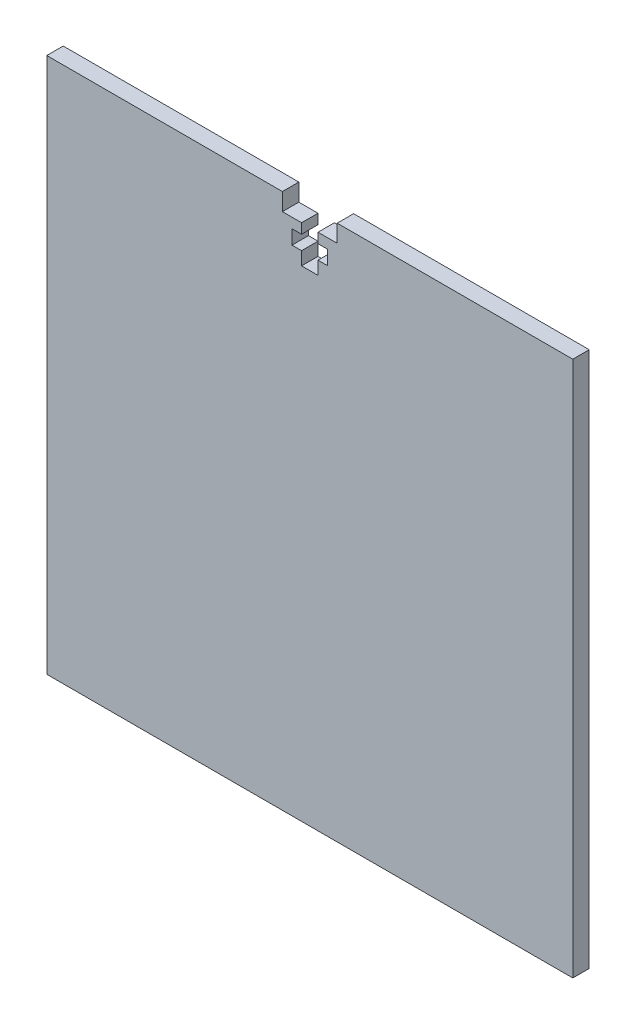
ISO-10303-21;
HEADER;
FILE_DESCRIPTION(('STEP AP214'),'2;1');
FILE_NAME('part.step','',(''),(''),'','','');
FILE_SCHEMA(('AUTOMOTIVE_DESIGN { 1 0 10303 214 1 1 1 1 }'));
ENDSEC;
DATA;
#1=APPLICATION_CONTEXT('core data for automotive mechanical design processes');
#2=APPLICATION_PROTOCOL_DEFINITION('international standard','automotive_design',2000,#1);
#3=PRODUCT_CONTEXT('',#1,'mechanical');
#4=PRODUCT('Part','Part','',(#3));
#5=PRODUCT_RELATED_PRODUCT_CATEGORY('part','',(#4));
#6=PRODUCT_DEFINITION_FORMATION('','',#4);
#7=PRODUCT_DEFINITION_CONTEXT('part definition',#1,'design');
#8=PRODUCT_DEFINITION('design','',#6,#7);
#9=PRODUCT_DEFINITION_SHAPE('','',#8);
#10=(LENGTH_UNIT() NAMED_UNIT(*) SI_UNIT(.MILLI.,.METRE.));
#11=(NAMED_UNIT(*) PLANE_ANGLE_UNIT() SI_UNIT($,.RADIAN.));
#12=(NAMED_UNIT(*) SI_UNIT($,.STERADIAN.) SOLID_ANGLE_UNIT());
#13=UNCERTAINTY_MEASURE_WITH_UNIT(LENGTH_MEASURE(1.E-05),#10,'distance_accuracy_value','');
#14=(GEOMETRIC_REPRESENTATION_CONTEXT(3) GLOBAL_UNCERTAINTY_ASSIGNED_CONTEXT((#13)) GLOBAL_UNIT_ASSIGNED_CONTEXT((#10,
#11,#12)) REPRESENTATION_CONTEXT('',''));
#15=CARTESIAN_POINT('',(0.,0.,0.));
#16=DIRECTION('',(0.,0.,1.));
#17=DIRECTION('',(1.,0.,0.));
#18=AXIS2_PLACEMENT_3D('',#15,#16,#17);
#19=CARTESIAN_POINT('',(-47.9962052336153,48.8993596331726,3.));
#20=DIRECTION('',(0.,-1.,0.));
#21=DIRECTION('',(0.,0.,-1.));
#22=AXIS2_PLACEMENT_3D('',#19,#20,#21);
#23=PLANE('',#22);
#24=DIRECTION('',(-1.,0.,0.));
#25=VECTOR('',#24,1.);
#26=CARTESIAN_POINT('',(-47.9962052336153,48.8993596331726,3.));
#27=LINE('',#26,#25);
#28=CARTESIAN_POINT('',(-5.,48.8993596331726,3.));
#29=VERTEX_POINT('',#28);
#30=CARTESIAN_POINT('',(-47.9962052336153,48.8993596331726,3.));
#31=VERTEX_POINT('',#30);
#32=EDGE_CURVE('E319',#29,#31,#27,.T.);
#33=ORIENTED_EDGE('',*,*,#32,.F.);
#34=DIRECTION('',(0.,0.,1.));
#35=VECTOR('',#34,1.);
#36=CARTESIAN_POINT('',(-5.,48.8993596331726,0.));
#37=LINE('',#36,#35);
#38=CARTESIAN_POINT('',(-5.,48.8993596331726,0.));
#39=VERTEX_POINT('',#38);
#40=EDGE_CURVE('E287',#39,#29,#37,.T.);
#41=ORIENTED_EDGE('',*,*,#40,.F.);
#42=DIRECTION('',(-1.,0.,0.));
#43=VECTOR('',#42,1.);
#44=CARTESIAN_POINT('',(-47.9962052336153,48.8993596331726,0.));
#45=LINE('',#44,#43);
#46=CARTESIAN_POINT('',(-47.9962052336153,48.8993596331726,0.));
#47=VERTEX_POINT('',#46);
#48=EDGE_CURVE('E207',#39,#47,#45,.T.);
#49=ORIENTED_EDGE('',*,*,#48,.T.);
#50=DIRECTION('',(0.,0.,-1.));
#51=VECTOR('',#50,1.);
#52=CARTESIAN_POINT('',(-47.9962052336153,48.8993596331726,3.));
#53=LINE('',#52,#51);
#54=EDGE_CURVE('E47',#31,#47,#53,.T.);
#55=ORIENTED_EDGE('',*,*,#54,.F.);
#56=EDGE_LOOP('',(#33,#41,#49,#55));
#57=FACE_BOUND('',#56,.T.);
#58=ADVANCED_FACE('F39',(#57),#23,.F.);
#59=CARTESIAN_POINT('',(47.9962052336153,48.8993596331726,3.));
#60=DIRECTION('',(-1.,0.,0.));
#61=DIRECTION('',(0.,0.,1.));
#62=AXIS2_PLACEMENT_3D('',#59,#60,#61);
#63=PLANE('',#62);
#64=DIRECTION('',(0.,1.,0.));
#65=VECTOR('',#64,1.);
#66=CARTESIAN_POINT('',(47.9962052336153,48.8993596331726,0.));
#67=LINE('',#66,#65);
#68=CARTESIAN_POINT('',(47.9962052336153,-48.8993596331726,0.));
#69=VERTEX_POINT('',#68);
#70=CARTESIAN_POINT('',(47.9962052336153,48.8993596331726,0.));
#71=VERTEX_POINT('',#70);
#72=EDGE_CURVE('E289',#69,#71,#67,.T.);
#73=ORIENTED_EDGE('',*,*,#72,.T.);
#74=DIRECTION('',(0.,0.,-1.));
#75=VECTOR('',#74,1.);
#76=CARTESIAN_POINT('',(47.9962052336153,48.8993596331726,3.));
#77=LINE('',#76,#75);
#78=CARTESIAN_POINT('',(47.9962052336153,48.8993596331726,3.));
#79=VERTEX_POINT('',#78);
#80=EDGE_CURVE('E11',#79,#71,#77,.T.);
#81=ORIENTED_EDGE('',*,*,#80,.F.);
#82=DIRECTION('',(0.,1.,0.));
#83=VECTOR('',#82,1.);
#84=CARTESIAN_POINT('',(47.9962052336153,48.8993596331726,3.));
#85=LINE('',#84,#83);
#86=CARTESIAN_POINT('',(47.9962052336153,-48.8993596331726,3.));
#87=VERTEX_POINT('',#86);
#88=EDGE_CURVE('E317',#87,#79,#85,.T.);
#89=ORIENTED_EDGE('',*,*,#88,.F.);
#90=DIRECTION('',(0.,0.,-1.));
#91=VECTOR('',#90,1.);
#92=CARTESIAN_POINT('',(47.9962052336153,-48.8993596331726,3.));
#93=LINE('',#92,#91);
#94=EDGE_CURVE('E325',#87,#69,#93,.T.);
#95=ORIENTED_EDGE('',*,*,#94,.T.);
#96=EDGE_LOOP('',(#73,#81,#89,#95));
#97=FACE_BOUND('',#96,.T.);
#98=ADVANCED_FACE('F41',(#97),#63,.F.);
#99=CARTESIAN_POINT('',(5.,48.8993596331726,0.));
#100=VERTEX_POINT('',#99);
#101=EDGE_CURVE('E328',#71,#100,#45,.T.);
#102=ORIENTED_EDGE('',*,*,#101,.T.);
#103=DIRECTION('',(0.,0.,1.));
#104=VECTOR('',#103,1.);
#105=CARTESIAN_POINT('',(5.,48.8993596331726,0.));
#106=LINE('',#105,#104);
#107=CARTESIAN_POINT('',(5.,48.8993596331726,3.));
#108=VERTEX_POINT('',#107);
#109=EDGE_CURVE('E290',#100,#108,#106,.T.);
#110=ORIENTED_EDGE('',*,*,#109,.T.);
#111=EDGE_CURVE('E91',#79,#108,#27,.T.);
#112=ORIENTED_EDGE('',*,*,#111,.F.);
#113=ORIENTED_EDGE('',*,*,#80,.T.);
#114=EDGE_LOOP('',(#102,#110,#112,#113));
#115=FACE_BOUND('',#114,.T.);
#116=ADVANCED_FACE('F357',(#115),#23,.F.);
#117=CARTESIAN_POINT('',(-47.9962052336153,48.8993596331726,3.));
#118=DIRECTION('',(1.,0.,0.));
#119=DIRECTION('',(0.,0.,-1.));
#120=AXIS2_PLACEMENT_3D('',#117,#118,#119);
#121=PLANE('',#120);
#122=DIRECTION('',(0.,-1.,0.));
#123=VECTOR('',#122,1.);
#124=CARTESIAN_POINT('',(-47.9962052336153,48.8993596331726,0.));
#125=LINE('',#124,#123);
#126=CARTESIAN_POINT('',(-47.9962052336153,-48.8993596331726,0.));
#127=VERTEX_POINT('',#126);
#128=EDGE_CURVE('E331',#47,#127,#125,.T.);
#129=ORIENTED_EDGE('',*,*,#128,.T.);
#130=DIRECTION('',(0.,0.,-1.));
#131=VECTOR('',#130,1.);
#132=CARTESIAN_POINT('',(-47.9962052336153,-48.8993596331726,3.));
#133=LINE('',#132,#131);
#134=CARTESIAN_POINT('',(-47.9962052336153,-48.8993596331726,3.));
#135=VERTEX_POINT('',#134);
#136=EDGE_CURVE('E335',#135,#127,#133,.T.);
#137=ORIENTED_EDGE('',*,*,#136,.F.);
#138=DIRECTION('',(0.,-1.,0.));
#139=VECTOR('',#138,1.);
#140=CARTESIAN_POINT('',(-47.9962052336153,48.8993596331726,3.));
#141=LINE('',#140,#139);
#142=EDGE_CURVE('E322',#31,#135,#141,.T.);
#143=ORIENTED_EDGE('',*,*,#142,.F.);
#144=ORIENTED_EDGE('',*,*,#54,.T.);
#145=EDGE_LOOP('',(#129,#137,#143,#144));
#146=FACE_BOUND('',#145,.T.);
#147=ADVANCED_FACE('F340',(#146),#121,.F.);
#148=CARTESIAN_POINT('',(-47.9962052336153,-48.8993596331726,3.));
#149=DIRECTION('',(0.,1.,0.));
#150=DIRECTION('',(0.,0.,1.));
#151=AXIS2_PLACEMENT_3D('',#148,#149,#150);
#152=PLANE('',#151);
#153=DIRECTION('',(1.,0.,0.));
#154=VECTOR('',#153,1.);
#155=CARTESIAN_POINT('',(-47.9962052336153,-48.8993596331726,0.));
#156=LINE('',#155,#154);
#157=EDGE_CURVE('E84',#127,#69,#156,.T.);
#158=ORIENTED_EDGE('',*,*,#157,.T.);
#159=ORIENTED_EDGE('',*,*,#94,.F.);
#160=DIRECTION('',(1.,0.,0.));
#161=VECTOR('',#160,1.);
#162=CARTESIAN_POINT('',(-47.9962052336153,-48.8993596331726,3.));
#163=LINE('',#162,#161);
#164=EDGE_CURVE('E63',#135,#87,#163,.T.);
#165=ORIENTED_EDGE('',*,*,#164,.F.);
#166=ORIENTED_EDGE('',*,*,#136,.T.);
#167=EDGE_LOOP('',(#158,#159,#165,#166));
#168=FACE_BOUND('',#167,.T.);
#169=ADVANCED_FACE('F348',(#168),#152,.F.);
#170=CARTESIAN_POINT('',(0.,0.,3.));
#171=DIRECTION('',(0.,0.,1.));
#172=DIRECTION('',(1.,0.,0.));
#173=AXIS2_PLACEMENT_3D('',#170,#171,#172);
#174=PLANE('',#173);
#175=DIRECTION('',(0.,-1.,0.));
#176=VECTOR('',#175,1.);
#177=CARTESIAN_POINT('',(-5.,48.8993596331726,3.));
#178=LINE('',#177,#176);
#179=CARTESIAN_POINT('',(-5.00000000000001,45.7193596331726,3.));
#180=VERTEX_POINT('',#179);
#181=EDGE_CURVE('E192',#29,#180,#178,.T.);
#182=ORIENTED_EDGE('',*,*,#181,.F.);
#183=ORIENTED_EDGE('',*,*,#32,.T.);
#184=ORIENTED_EDGE('',*,*,#142,.T.);
#185=ORIENTED_EDGE('',*,*,#164,.T.);
#186=ORIENTED_EDGE('',*,*,#88,.T.);
#187=ORIENTED_EDGE('',*,*,#111,.T.);
#188=DIRECTION('',(0.,1.,0.));
#189=VECTOR('',#188,1.);
#190=CARTESIAN_POINT('',(5.,48.8993596331726,3.));
#191=LINE('',#190,#189);
#192=CARTESIAN_POINT('',(4.99999999999999,45.7193596331726,3.));
#193=VERTEX_POINT('',#192);
#194=EDGE_CURVE('E208',#193,#108,#191,.T.);
#195=ORIENTED_EDGE('',*,*,#194,.F.);
#196=DIRECTION('',(1.,0.,0.));
#197=VECTOR('',#196,1.);
#198=CARTESIAN_POINT('',(1.5,45.7193596331726,3.));
#199=LINE('',#198,#197);
#200=CARTESIAN_POINT('',(1.5,45.7193596331726,3.));
#201=VERTEX_POINT('',#200);
#202=EDGE_CURVE('E210',#201,#193,#199,.T.);
#203=ORIENTED_EDGE('',*,*,#202,.F.);
#204=DIRECTION('',(0.,1.,0.));
#205=VECTOR('',#204,1.);
#206=CARTESIAN_POINT('',(1.5,45.7193596331726,3.));
#207=LINE('',#206,#205);
#208=CARTESIAN_POINT('',(1.5,43.8993596331726,3.));
#209=VERTEX_POINT('',#208);
#210=EDGE_CURVE('E282',#209,#201,#207,.T.);
#211=ORIENTED_EDGE('',*,*,#210,.F.);
#212=DIRECTION('',(-1.,0.,0.));
#213=VECTOR('',#212,1.);
#214=CARTESIAN_POINT('',(3.25000000000001,43.8993596331726,3.));
#215=LINE('',#214,#213);
#216=CARTESIAN_POINT('',(3.25000000000001,43.8993596331726,3.));
#217=VERTEX_POINT('',#216);
#218=EDGE_CURVE('E279',#217,#209,#215,.T.);
#219=ORIENTED_EDGE('',*,*,#218,.F.);
#220=DIRECTION('',(0.,1.,0.));
#221=VECTOR('',#220,1.);
#222=CARTESIAN_POINT('',(3.25000000000001,43.8993596331726,3.));
#223=LINE('',#222,#221);
#224=CARTESIAN_POINT('',(3.24999999999999,41.2993596331726,3.));
#225=VERTEX_POINT('',#224);
#226=EDGE_CURVE('E276',#225,#217,#223,.T.);
#227=ORIENTED_EDGE('',*,*,#226,.F.);
#228=DIRECTION('',(1.,0.,0.));
#229=VECTOR('',#228,1.);
#230=CARTESIAN_POINT('',(1.5,41.2993596331726,3.));
#231=LINE('',#230,#229);
#232=CARTESIAN_POINT('',(1.5,41.2993596331726,3.));
#233=VERTEX_POINT('',#232);
#234=EDGE_CURVE('E273',#233,#225,#231,.T.);
#235=ORIENTED_EDGE('',*,*,#234,.F.);
#236=DIRECTION('',(0.,1.,0.));
#237=VECTOR('',#236,1.);
#238=CARTESIAN_POINT('',(1.5,41.2993596331726,3.));
#239=LINE('',#238,#237);
#240=CARTESIAN_POINT('',(1.5,38.8993596331726,3.));
#241=VERTEX_POINT('',#240);
#242=EDGE_CURVE('E270',#241,#233,#239,.T.);
#243=ORIENTED_EDGE('',*,*,#242,.F.);
#244=DIRECTION('',(1.,0.,0.));
#245=VECTOR('',#244,1.);
#246=CARTESIAN_POINT('',(-1.5,38.8993596331726,3.));
#247=LINE('',#246,#245);
#248=CARTESIAN_POINT('',(-1.5,38.8993596331726,3.));
#249=VERTEX_POINT('',#248);
#250=EDGE_CURVE('E267',#249,#241,#247,.T.);
#251=ORIENTED_EDGE('',*,*,#250,.F.);
#252=DIRECTION('',(0.,-1.,0.));
#253=VECTOR('',#252,1.);
#254=CARTESIAN_POINT('',(-1.5,41.2993596331726,3.));
#255=LINE('',#254,#253);
#256=CARTESIAN_POINT('',(-1.5,41.2993596331726,3.));
#257=VERTEX_POINT('',#256);
#258=EDGE_CURVE('E264',#257,#249,#255,.T.);
#259=ORIENTED_EDGE('',*,*,#258,.F.);
#260=DIRECTION('',(1.,0.,0.));
#261=VECTOR('',#260,1.);
#262=CARTESIAN_POINT('',(-3.25000000000001,41.2993596331726,3.));
#263=LINE('',#262,#261);
#264=CARTESIAN_POINT('',(-3.25000000000001,41.2993596331726,3.));
#265=VERTEX_POINT('',#264);
#266=EDGE_CURVE('E261',#265,#257,#263,.T.);
#267=ORIENTED_EDGE('',*,*,#266,.F.);
#268=DIRECTION('',(0.,-1.,0.));
#269=VECTOR('',#268,1.);
#270=CARTESIAN_POINT('',(-3.25000000000001,43.8993596331726,3.));
#271=LINE('',#270,#269);
#272=CARTESIAN_POINT('',(-3.25000000000001,43.8993596331726,3.));
#273=VERTEX_POINT('',#272);
#274=EDGE_CURVE('E258',#273,#265,#271,.T.);
#275=ORIENTED_EDGE('',*,*,#274,.F.);
#276=DIRECTION('',(-1.,0.,0.));
#277=VECTOR('',#276,1.);
#278=CARTESIAN_POINT('',(-3.25000000000001,43.8993596331726,3.));
#279=LINE('',#278,#277);
#280=CARTESIAN_POINT('',(-1.5,43.8993596331726,3.));
#281=VERTEX_POINT('',#280);
#282=EDGE_CURVE('E255',#281,#273,#279,.T.);
#283=ORIENTED_EDGE('',*,*,#282,.F.);
#284=DIRECTION('',(0.,-1.,0.));
#285=VECTOR('',#284,1.);
#286=CARTESIAN_POINT('',(-1.5,45.7193596331726,3.));
#287=LINE('',#286,#285);
#288=CARTESIAN_POINT('',(-1.5,45.7193596331726,3.));
#289=VERTEX_POINT('',#288);
#290=EDGE_CURVE('E252',#289,#281,#287,.T.);
#291=ORIENTED_EDGE('',*,*,#290,.F.);
#292=DIRECTION('',(1.,0.,0.));
#293=VECTOR('',#292,1.);
#294=CARTESIAN_POINT('',(-5.00000000000001,45.7193596331726,3.));
#295=LINE('',#294,#293);
#296=EDGE_CURVE('E250',#180,#289,#295,.T.);
#297=ORIENTED_EDGE('',*,*,#296,.F.);
#298=EDGE_LOOP('',(#182,#183,#184,#185,#186,#187,#195,#203,#211,#219,#227,#235,#243,#251,#259,
#267,#275,#283,#291,#297));
#299=FACE_BOUND('',#298,.T.);
#300=ADVANCED_FACE('F350',(#299),#174,.T.);
#301=CARTESIAN_POINT('',(0.,0.,0.));
#302=DIRECTION('',(0.,0.,1.));
#303=DIRECTION('',(1.,0.,0.));
#304=AXIS2_PLACEMENT_3D('',#301,#302,#303);
#305=PLANE('',#304);
#306=ORIENTED_EDGE('',*,*,#48,.F.);
#307=DIRECTION('',(0.,-1.,0.));
#308=VECTOR('',#307,1.);
#309=CARTESIAN_POINT('',(-5.,48.8993596331726,0.));
#310=LINE('',#309,#308);
#311=CARTESIAN_POINT('',(-5.00000000000001,45.7193596331726,0.));
#312=VERTEX_POINT('',#311);
#313=EDGE_CURVE('E189',#39,#312,#310,.T.);
#314=ORIENTED_EDGE('',*,*,#313,.T.);
#315=DIRECTION('',(1.,0.,0.));
#316=VECTOR('',#315,1.);
#317=CARTESIAN_POINT('',(-5.00000000000001,45.7193596331726,0.));
#318=LINE('',#317,#316);
#319=CARTESIAN_POINT('',(-1.5,45.7193596331726,0.));
#320=VERTEX_POINT('',#319);
#321=EDGE_CURVE('E200',#312,#320,#318,.T.);
#322=ORIENTED_EDGE('',*,*,#321,.T.);
#323=DIRECTION('',(0.,-1.,0.));
#324=VECTOR('',#323,1.);
#325=CARTESIAN_POINT('',(-1.5,45.7193596331726,0.));
#326=LINE('',#325,#324);
#327=CARTESIAN_POINT('',(-1.5,43.8993596331726,0.));
#328=VERTEX_POINT('',#327);
#329=EDGE_CURVE('E54',#320,#328,#326,.T.);
#330=ORIENTED_EDGE('',*,*,#329,.T.);
#331=DIRECTION('',(-1.,0.,0.));
#332=VECTOR('',#331,1.);
#333=CARTESIAN_POINT('',(-3.25000000000001,43.8993596331726,0.));
#334=LINE('',#333,#332);
#335=CARTESIAN_POINT('',(-3.25000000000001,43.8993596331726,0.));
#336=VERTEX_POINT('',#335);
#337=EDGE_CURVE('E214',#328,#336,#334,.T.);
#338=ORIENTED_EDGE('',*,*,#337,.T.);
#339=DIRECTION('',(0.,-1.,0.));
#340=VECTOR('',#339,1.);
#341=CARTESIAN_POINT('',(-3.25000000000001,43.8993596331726,0.));
#342=LINE('',#341,#340);
#343=CARTESIAN_POINT('',(-3.25000000000001,41.2993596331726,0.));
#344=VERTEX_POINT('',#343);
#345=EDGE_CURVE('E217',#336,#344,#342,.T.);
#346=ORIENTED_EDGE('',*,*,#345,.T.);
#347=DIRECTION('',(1.,0.,0.));
#348=VECTOR('',#347,1.);
#349=CARTESIAN_POINT('',(-3.25000000000001,41.2993596331726,0.));
#350=LINE('',#349,#348);
#351=CARTESIAN_POINT('',(-1.5,41.2993596331726,0.));
#352=VERTEX_POINT('',#351);
#353=EDGE_CURVE('E220',#344,#352,#350,.T.);
#354=ORIENTED_EDGE('',*,*,#353,.T.);
#355=DIRECTION('',(0.,-1.,0.));
#356=VECTOR('',#355,1.);
#357=CARTESIAN_POINT('',(-1.5,41.2993596331726,0.));
#358=LINE('',#357,#356);
#359=CARTESIAN_POINT('',(-1.5,38.8993596331726,0.));
#360=VERTEX_POINT('',#359);
#361=EDGE_CURVE('E223',#352,#360,#358,.T.);
#362=ORIENTED_EDGE('',*,*,#361,.T.);
#363=DIRECTION('',(1.,0.,0.));
#364=VECTOR('',#363,1.);
#365=CARTESIAN_POINT('',(-1.5,38.8993596331726,0.));
#366=LINE('',#365,#364);
#367=CARTESIAN_POINT('',(1.5,38.8993596331726,0.));
#368=VERTEX_POINT('',#367);
#369=EDGE_CURVE('E226',#360,#368,#366,.T.);
#370=ORIENTED_EDGE('',*,*,#369,.T.);
#371=DIRECTION('',(0.,1.,0.));
#372=VECTOR('',#371,1.);
#373=CARTESIAN_POINT('',(1.5,41.2993596331726,0.));
#374=LINE('',#373,#372);
#375=CARTESIAN_POINT('',(1.5,41.2993596331726,0.));
#376=VERTEX_POINT('',#375);
#377=EDGE_CURVE('E229',#368,#376,#374,.T.);
#378=ORIENTED_EDGE('',*,*,#377,.T.);
#379=DIRECTION('',(1.,0.,0.));
#380=VECTOR('',#379,1.);
#381=CARTESIAN_POINT('',(1.5,41.2993596331726,0.));
#382=LINE('',#381,#380);
#383=CARTESIAN_POINT('',(3.24999999999999,41.2993596331726,0.));
#384=VERTEX_POINT('',#383);
#385=EDGE_CURVE('E232',#376,#384,#382,.T.);
#386=ORIENTED_EDGE('',*,*,#385,.T.);
#387=DIRECTION('',(0.,1.,0.));
#388=VECTOR('',#387,1.);
#389=CARTESIAN_POINT('',(3.25000000000001,43.8993596331726,0.));
#390=LINE('',#389,#388);
#391=CARTESIAN_POINT('',(3.25000000000001,43.8993596331726,0.));
#392=VERTEX_POINT('',#391);
#393=EDGE_CURVE('E235',#384,#392,#390,.T.);
#394=ORIENTED_EDGE('',*,*,#393,.T.);
#395=DIRECTION('',(-1.,0.,0.));
#396=VECTOR('',#395,1.);
#397=CARTESIAN_POINT('',(3.25000000000001,43.8993596331726,0.));
#398=LINE('',#397,#396);
#399=CARTESIAN_POINT('',(1.5,43.8993596331726,0.));
#400=VERTEX_POINT('',#399);
#401=EDGE_CURVE('E238',#392,#400,#398,.T.);
#402=ORIENTED_EDGE('',*,*,#401,.T.);
#403=DIRECTION('',(0.,1.,0.));
#404=VECTOR('',#403,1.);
#405=CARTESIAN_POINT('',(1.5,45.7193596331726,0.));
#406=LINE('',#405,#404);
#407=CARTESIAN_POINT('',(1.5,45.7193596331726,0.));
#408=VERTEX_POINT('',#407);
#409=EDGE_CURVE('E241',#400,#408,#406,.T.);
#410=ORIENTED_EDGE('',*,*,#409,.T.);
#411=DIRECTION('',(1.,0.,0.));
#412=VECTOR('',#411,1.);
#413=CARTESIAN_POINT('',(1.5,45.7193596331726,0.));
#414=LINE('',#413,#412);
#415=CARTESIAN_POINT('',(4.99999999999999,45.7193596331726,0.));
#416=VERTEX_POINT('',#415);
#417=EDGE_CURVE('E244',#408,#416,#414,.T.);
#418=ORIENTED_EDGE('',*,*,#417,.T.);
#419=DIRECTION('',(0.,1.,0.));
#420=VECTOR('',#419,1.);
#421=CARTESIAN_POINT('',(5.,48.8993596331726,0.));
#422=LINE('',#421,#420);
#423=EDGE_CURVE('E197',#416,#100,#422,.T.);
#424=ORIENTED_EDGE('',*,*,#423,.T.);
#425=ORIENTED_EDGE('',*,*,#101,.F.);
#426=ORIENTED_EDGE('',*,*,#72,.F.);
#427=ORIENTED_EDGE('',*,*,#157,.F.);
#428=ORIENTED_EDGE('',*,*,#128,.F.);
#429=EDGE_LOOP('',(#306,#314,#322,#330,#338,#346,#354,#362,#370,#378,#386,#394,#402,#410,#418,
#424,#425,#426,#427,#428));
#430=FACE_BOUND('',#429,.T.);
#431=ADVANCED_FACE('F205',(#430),#305,.F.);
#432=CARTESIAN_POINT('',(-5.,48.8993596331726,0.));
#433=DIRECTION('',(-1.,0.,0.));
#434=DIRECTION('',(0.,-1.,0.));
#435=AXIS2_PLACEMENT_3D('',#432,#433,#434);
#436=PLANE('',#435);
#437=ORIENTED_EDGE('',*,*,#181,.T.);
#438=DIRECTION('',(0.,0.,1.));
#439=VECTOR('',#438,1.);
#440=CARTESIAN_POINT('',(-5.00000000000001,45.7193596331726,0.));
#441=LINE('',#440,#439);
#442=EDGE_CURVE('E185',#312,#180,#441,.T.);
#443=ORIENTED_EDGE('',*,*,#442,.F.);
#444=ORIENTED_EDGE('',*,*,#313,.F.);
#445=ORIENTED_EDGE('',*,*,#40,.T.);
#446=EDGE_LOOP('',(#437,#443,#444,#445));
#447=FACE_BOUND('',#446,.T.);
#448=ADVANCED_FACE('F187',(#447),#436,.F.);
#449=CARTESIAN_POINT('',(5.,48.8993596331726,0.));
#450=DIRECTION('',(1.,0.,0.));
#451=DIRECTION('',(0.,1.,0.));
#452=AXIS2_PLACEMENT_3D('',#449,#450,#451);
#453=PLANE('',#452);
#454=ORIENTED_EDGE('',*,*,#194,.T.);
#455=ORIENTED_EDGE('',*,*,#109,.F.);
#456=ORIENTED_EDGE('',*,*,#423,.F.);
#457=DIRECTION('',(0.,0.,1.));
#458=VECTOR('',#457,1.);
#459=CARTESIAN_POINT('',(4.99999999999999,45.7193596331726,0.));
#460=LINE('',#459,#458);
#461=EDGE_CURVE('E292',#416,#193,#460,.T.);
#462=ORIENTED_EDGE('',*,*,#461,.T.);
#463=EDGE_LOOP('',(#454,#455,#456,#462));
#464=FACE_BOUND('',#463,.T.);
#465=ADVANCED_FACE('F372',(#464),#453,.F.);
#466=CARTESIAN_POINT('',(1.5,45.7193596331726,0.));
#467=DIRECTION('',(0.,-1.,0.));
#468=DIRECTION('',(1.,0.,0.));
#469=AXIS2_PLACEMENT_3D('',#466,#467,#468);
#470=PLANE('',#469);
#471=ORIENTED_EDGE('',*,*,#202,.T.);
#472=ORIENTED_EDGE('',*,*,#461,.F.);
#473=ORIENTED_EDGE('',*,*,#417,.F.);
#474=DIRECTION('',(0.,0.,1.));
#475=VECTOR('',#474,1.);
#476=CARTESIAN_POINT('',(1.5,45.7193596331726,0.));
#477=LINE('',#476,#475);
#478=EDGE_CURVE('E294',#408,#201,#477,.T.);
#479=ORIENTED_EDGE('',*,*,#478,.T.);
#480=EDGE_LOOP('',(#471,#472,#473,#479));
#481=FACE_BOUND('',#480,.T.);
#482=ADVANCED_FACE('F375',(#481),#470,.F.);
#483=CARTESIAN_POINT('',(1.5,45.7193596331726,0.));
#484=DIRECTION('',(1.,0.,0.));
#485=DIRECTION('',(0.,1.,0.));
#486=AXIS2_PLACEMENT_3D('',#483,#484,#485);
#487=PLANE('',#486);
#488=ORIENTED_EDGE('',*,*,#210,.T.);
#489=ORIENTED_EDGE('',*,*,#478,.F.);
#490=ORIENTED_EDGE('',*,*,#409,.F.);
#491=DIRECTION('',(0.,0.,1.));
#492=VECTOR('',#491,1.);
#493=CARTESIAN_POINT('',(1.5,43.8993596331726,0.));
#494=LINE('',#493,#492);
#495=EDGE_CURVE('E296',#400,#209,#494,.T.);
#496=ORIENTED_EDGE('',*,*,#495,.T.);
#497=EDGE_LOOP('',(#488,#489,#490,#496));
#498=FACE_BOUND('',#497,.T.);
#499=ADVANCED_FACE('F378',(#498),#487,.F.);
#500=CARTESIAN_POINT('',(3.25000000000001,43.8993596331726,0.));
#501=DIRECTION('',(0.,1.,0.));
#502=DIRECTION('',(0.,0.,1.));
#503=AXIS2_PLACEMENT_3D('',#500,#501,#502);
#504=PLANE('',#503);
#505=ORIENTED_EDGE('',*,*,#218,.T.);
#506=ORIENTED_EDGE('',*,*,#495,.F.);
#507=ORIENTED_EDGE('',*,*,#401,.F.);
#508=DIRECTION('',(0.,0.,1.));
#509=VECTOR('',#508,1.);
#510=CARTESIAN_POINT('',(3.25000000000001,43.8993596331726,0.));
#511=LINE('',#510,#509);
#512=EDGE_CURVE('E298',#392,#217,#511,.T.);
#513=ORIENTED_EDGE('',*,*,#512,.T.);
#514=EDGE_LOOP('',(#505,#506,#507,#513));
#515=FACE_BOUND('',#514,.T.);
#516=ADVANCED_FACE('F383',(#515),#504,.F.);
#517=CARTESIAN_POINT('',(3.25000000000001,43.8993596331726,0.));
#518=DIRECTION('',(1.,0.,0.));
#519=DIRECTION('',(0.,1.,0.));
#520=AXIS2_PLACEMENT_3D('',#517,#518,#519);
#521=PLANE('',#520);
#522=ORIENTED_EDGE('',*,*,#226,.T.);
#523=ORIENTED_EDGE('',*,*,#512,.F.);
#524=ORIENTED_EDGE('',*,*,#393,.F.);
#525=DIRECTION('',(0.,0.,1.));
#526=VECTOR('',#525,1.);
#527=CARTESIAN_POINT('',(3.24999999999999,41.2993596331726,0.));
#528=LINE('',#527,#526);
#529=EDGE_CURVE('E300',#384,#225,#528,.T.);
#530=ORIENTED_EDGE('',*,*,#529,.T.);
#531=EDGE_LOOP('',(#522,#523,#524,#530));
#532=FACE_BOUND('',#531,.T.);
#533=ADVANCED_FACE('F387',(#532),#521,.F.);
#534=CARTESIAN_POINT('',(1.5,41.2993596331726,0.));
#535=DIRECTION('',(0.,-1.,0.));
#536=DIRECTION('',(0.,0.,-1.));
#537=AXIS2_PLACEMENT_3D('',#534,#535,#536);
#538=PLANE('',#537);
#539=ORIENTED_EDGE('',*,*,#234,.T.);
#540=ORIENTED_EDGE('',*,*,#529,.F.);
#541=ORIENTED_EDGE('',*,*,#385,.F.);
#542=DIRECTION('',(0.,0.,1.));
#543=VECTOR('',#542,1.);
#544=CARTESIAN_POINT('',(1.5,41.2993596331726,0.));
#545=LINE('',#544,#543);
#546=EDGE_CURVE('E302',#376,#233,#545,.T.);
#547=ORIENTED_EDGE('',*,*,#546,.T.);
#548=EDGE_LOOP('',(#539,#540,#541,#547));
#549=FACE_BOUND('',#548,.T.);
#550=ADVANCED_FACE('F390',(#549),#538,.F.);
#551=CARTESIAN_POINT('',(1.5,41.2993596331726,0.));
#552=DIRECTION('',(1.,0.,0.));
#553=DIRECTION('',(0.,0.,-1.));
#554=AXIS2_PLACEMENT_3D('',#551,#552,#553);
#555=PLANE('',#554);
#556=ORIENTED_EDGE('',*,*,#242,.T.);
#557=ORIENTED_EDGE('',*,*,#546,.F.);
#558=ORIENTED_EDGE('',*,*,#377,.F.);
#559=DIRECTION('',(0.,0.,1.));
#560=VECTOR('',#559,1.);
#561=CARTESIAN_POINT('',(1.5,38.8993596331726,0.));
#562=LINE('',#561,#560);
#563=EDGE_CURVE('E304',#368,#241,#562,.T.);
#564=ORIENTED_EDGE('',*,*,#563,.T.);
#565=EDGE_LOOP('',(#556,#557,#558,#564));
#566=FACE_BOUND('',#565,.T.);
#567=ADVANCED_FACE('F395',(#566),#555,.F.);
#568=CARTESIAN_POINT('',(-1.5,38.8993596331726,0.));
#569=DIRECTION('',(0.,-1.,0.));
#570=DIRECTION('',(0.,0.,-1.));
#571=AXIS2_PLACEMENT_3D('',#568,#569,#570);
#572=PLANE('',#571);
#573=ORIENTED_EDGE('',*,*,#250,.T.);
#574=ORIENTED_EDGE('',*,*,#563,.F.);
#575=ORIENTED_EDGE('',*,*,#369,.F.);
#576=DIRECTION('',(0.,0.,1.));
#577=VECTOR('',#576,1.);
#578=CARTESIAN_POINT('',(-1.5,38.8993596331726,0.));
#579=LINE('',#578,#577);
#580=EDGE_CURVE('E306',#360,#249,#579,.T.);
#581=ORIENTED_EDGE('',*,*,#580,.T.);
#582=EDGE_LOOP('',(#573,#574,#575,#581));
#583=FACE_BOUND('',#582,.T.);
#584=ADVANCED_FACE('F399',(#583),#572,.F.);
#585=CARTESIAN_POINT('',(-1.5,41.2993596331726,0.));
#586=DIRECTION('',(-1.,0.,0.));
#587=DIRECTION('',(0.,0.,1.));
#588=AXIS2_PLACEMENT_3D('',#585,#586,#587);
#589=PLANE('',#588);
#590=ORIENTED_EDGE('',*,*,#258,.T.);
#591=ORIENTED_EDGE('',*,*,#580,.F.);
#592=ORIENTED_EDGE('',*,*,#361,.F.);
#593=DIRECTION('',(0.,0.,1.));
#594=VECTOR('',#593,1.);
#595=CARTESIAN_POINT('',(-1.5,41.2993596331726,0.));
#596=LINE('',#595,#594);
#597=EDGE_CURVE('E308',#352,#257,#596,.T.);
#598=ORIENTED_EDGE('',*,*,#597,.T.);
#599=EDGE_LOOP('',(#590,#591,#592,#598));
#600=FACE_BOUND('',#599,.T.);
#601=ADVANCED_FACE('F402',(#600),#589,.F.);
#602=CARTESIAN_POINT('',(-3.25000000000001,41.2993596331726,0.));
#603=DIRECTION('',(0.,-1.,0.));
#604=DIRECTION('',(0.,0.,-1.));
#605=AXIS2_PLACEMENT_3D('',#602,#603,#604);
#606=PLANE('',#605);
#607=ORIENTED_EDGE('',*,*,#266,.T.);
#608=ORIENTED_EDGE('',*,*,#597,.F.);
#609=ORIENTED_EDGE('',*,*,#353,.F.);
#610=DIRECTION('',(0.,0.,1.));
#611=VECTOR('',#610,1.);
#612=CARTESIAN_POINT('',(-3.25000000000001,41.2993596331726,0.));
#613=LINE('',#612,#611);
#614=EDGE_CURVE('E310',#344,#265,#613,.T.);
#615=ORIENTED_EDGE('',*,*,#614,.T.);
#616=EDGE_LOOP('',(#607,#608,#609,#615));
#617=FACE_BOUND('',#616,.T.);
#618=ADVANCED_FACE('F407',(#617),#606,.F.);
#619=CARTESIAN_POINT('',(-3.25000000000001,43.8993596331726,0.));
#620=DIRECTION('',(-1.,0.,0.));
#621=DIRECTION('',(0.,-1.,0.));
#622=AXIS2_PLACEMENT_3D('',#619,#620,#621);
#623=PLANE('',#622);
#624=ORIENTED_EDGE('',*,*,#274,.T.);
#625=ORIENTED_EDGE('',*,*,#614,.F.);
#626=ORIENTED_EDGE('',*,*,#345,.F.);
#627=DIRECTION('',(0.,0.,1.));
#628=VECTOR('',#627,1.);
#629=CARTESIAN_POINT('',(-3.25000000000001,43.8993596331726,0.));
#630=LINE('',#629,#628);
#631=EDGE_CURVE('E312',#336,#273,#630,.T.);
#632=ORIENTED_EDGE('',*,*,#631,.T.);
#633=EDGE_LOOP('',(#624,#625,#626,#632));
#634=FACE_BOUND('',#633,.T.);
#635=ADVANCED_FACE('F411',(#634),#623,.F.);
#636=CARTESIAN_POINT('',(-3.25000000000001,43.8993596331726,0.));
#637=DIRECTION('',(0.,1.,0.));
#638=DIRECTION('',(0.,0.,1.));
#639=AXIS2_PLACEMENT_3D('',#636,#637,#638);
#640=PLANE('',#639);
#641=ORIENTED_EDGE('',*,*,#282,.T.);
#642=ORIENTED_EDGE('',*,*,#631,.F.);
#643=ORIENTED_EDGE('',*,*,#337,.F.);
#644=DIRECTION('',(0.,0.,1.));
#645=VECTOR('',#644,1.);
#646=CARTESIAN_POINT('',(-1.5,43.8993596331726,0.));
#647=LINE('',#646,#645);
#648=EDGE_CURVE('E314',#328,#281,#647,.T.);
#649=ORIENTED_EDGE('',*,*,#648,.T.);
#650=EDGE_LOOP('',(#641,#642,#643,#649));
#651=FACE_BOUND('',#650,.T.);
#652=ADVANCED_FACE('F414',(#651),#640,.F.);
#653=CARTESIAN_POINT('',(-1.5,45.7193596331726,0.));
#654=DIRECTION('',(-1.,0.,0.));
#655=DIRECTION('',(0.,-1.,0.));
#656=AXIS2_PLACEMENT_3D('',#653,#654,#655);
#657=PLANE('',#656);
#658=ORIENTED_EDGE('',*,*,#290,.T.);
#659=ORIENTED_EDGE('',*,*,#648,.F.);
#660=ORIENTED_EDGE('',*,*,#329,.F.);
#661=DIRECTION('',(0.,0.,1.));
#662=VECTOR('',#661,1.);
#663=CARTESIAN_POINT('',(-1.5,45.7193596331726,0.));
#664=LINE('',#663,#662);
#665=EDGE_CURVE('E196',#320,#289,#664,.T.);
#666=ORIENTED_EDGE('',*,*,#665,.T.);
#667=EDGE_LOOP('',(#658,#659,#660,#666));
#668=FACE_BOUND('',#667,.T.);
#669=ADVANCED_FACE('F416',(#668),#657,.F.);
#670=CARTESIAN_POINT('',(-5.00000000000001,45.7193596331726,0.));
#671=DIRECTION('',(0.,-1.,0.));
#672=DIRECTION('',(0.,0.,-1.));
#673=AXIS2_PLACEMENT_3D('',#670,#671,#672);
#674=PLANE('',#673);
#675=ORIENTED_EDGE('',*,*,#296,.T.);
#676=ORIENTED_EDGE('',*,*,#665,.F.);
#677=ORIENTED_EDGE('',*,*,#321,.F.);
#678=ORIENTED_EDGE('',*,*,#442,.T.);
#679=EDGE_LOOP('',(#675,#676,#677,#678));
#680=FACE_BOUND('',#679,.T.);
#681=ADVANCED_FACE('F201',(#680),#674,.F.);
#682=CLOSED_SHELL('',(#58,#98,#116,#147,#169,#300,#431,#448,#465,#482,#499,#516,#533,#550,#567,
#584,#601,#618,#635,#652,#669,#681));
#683=MANIFOLD_SOLID_BREP('B2',#682);
#684=ADVANCED_BREP_SHAPE_REPRESENTATION('',(#18,#683),#14);
#685=SHAPE_DEFINITION_REPRESENTATION(#9,#684);
ENDSEC;
END-ISO-10303-21;
